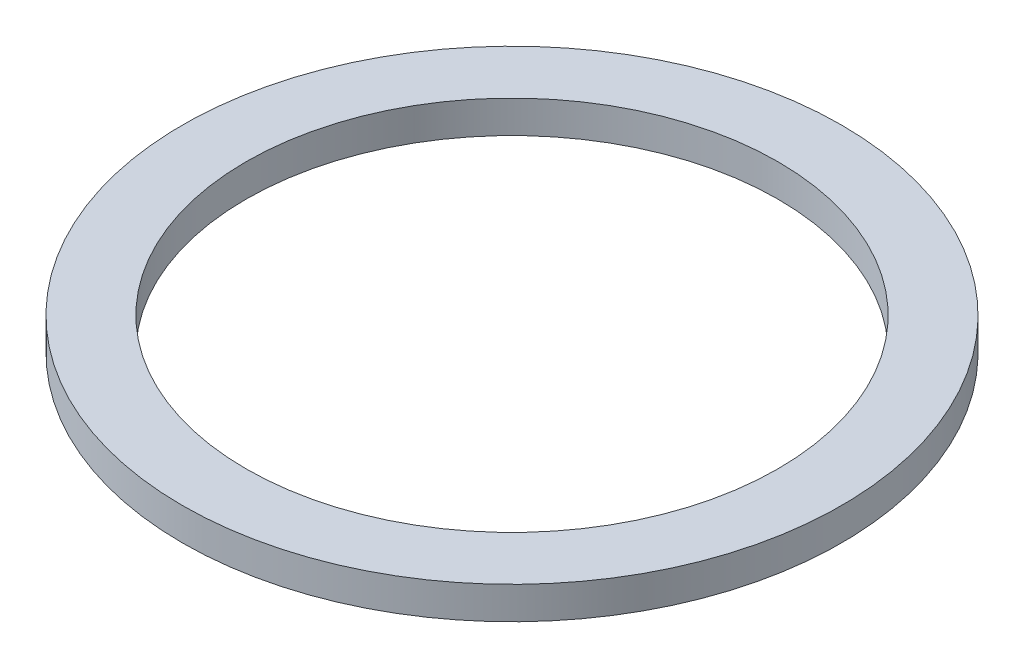
ISO-10303-21;
HEADER;
FILE_DESCRIPTION(('STEP AP214'),'2;1');
FILE_NAME('part.step','',(''),(''),'','','');
FILE_SCHEMA(('AUTOMOTIVE_DESIGN { 1 0 10303 214 1 1 1 1 }'));
ENDSEC;
DATA;
#1=APPLICATION_CONTEXT('core data for automotive mechanical design processes');
#2=APPLICATION_PROTOCOL_DEFINITION('international standard','automotive_design',2000,#1);
#3=PRODUCT_CONTEXT('',#1,'mechanical');
#4=PRODUCT('Part','Part','',(#3));
#5=PRODUCT_RELATED_PRODUCT_CATEGORY('part','',(#4));
#6=PRODUCT_DEFINITION_FORMATION('','',#4);
#7=PRODUCT_DEFINITION_CONTEXT('part definition',#1,'design');
#8=PRODUCT_DEFINITION('design','',#6,#7);
#9=PRODUCT_DEFINITION_SHAPE('','',#8);
#10=(LENGTH_UNIT() NAMED_UNIT(*) SI_UNIT(.MILLI.,.METRE.));
#11=(NAMED_UNIT(*) PLANE_ANGLE_UNIT() SI_UNIT($,.RADIAN.));
#12=(NAMED_UNIT(*) SI_UNIT($,.STERADIAN.) SOLID_ANGLE_UNIT());
#13=UNCERTAINTY_MEASURE_WITH_UNIT(LENGTH_MEASURE(1.E-05),#10,'distance_accuracy_value','');
#14=(GEOMETRIC_REPRESENTATION_CONTEXT(3) GLOBAL_UNCERTAINTY_ASSIGNED_CONTEXT((#13)) GLOBAL_UNIT_ASSIGNED_CONTEXT((#10,
#11,#12)) REPRESENTATION_CONTEXT('',''));
#15=CARTESIAN_POINT('',(0.,0.,0.));
#16=DIRECTION('',(0.,0.,1.));
#17=DIRECTION('',(1.,0.,0.));
#18=AXIS2_PLACEMENT_3D('',#15,#16,#17);
#19=CARTESIAN_POINT('',(20.5,0.,0.));
#20=DIRECTION('',(0.,1.,0.));
#21=DIRECTION('',(0.,0.,1.));
#22=AXIS2_PLACEMENT_3D('',#19,#20,#21);
#23=PLANE('',#22);
#24=CARTESIAN_POINT('',(0.,0.,0.));
#25=DIRECTION('',(0.,1.,0.));
#26=DIRECTION('',(0.,0.,1.));
#27=AXIS2_PLACEMENT_3D('',#24,#25,#26);
#28=CIRCLE('',#27,25.4);
#29=CARTESIAN_POINT('',(0.,0.,25.4));
#30=VERTEX_POINT('',#29);
#31=EDGE_CURVE('E10',#30,#30,#28,.T.);
#32=ORIENTED_EDGE('',*,*,#31,.F.);
#33=EDGE_LOOP('',(#32));
#34=FACE_BOUND('',#33,.T.);
#35=CARTESIAN_POINT('',(0.,0.,0.));
#36=DIRECTION('',(0.,1.,0.));
#37=DIRECTION('',(0.,0.,1.));
#38=AXIS2_PLACEMENT_3D('',#35,#36,#37);
#39=CIRCLE('',#38,20.5);
#40=CARTESIAN_POINT('',(0.,0.,20.5));
#41=VERTEX_POINT('',#40);
#42=EDGE_CURVE('E51',#41,#41,#39,.T.);
#43=ORIENTED_EDGE('',*,*,#42,.T.);
#44=EDGE_LOOP('',(#43));
#45=FACE_BOUND('',#44,.T.);
#46=ADVANCED_FACE('F37',(#34,#45),#23,.F.);
#47=CARTESIAN_POINT('',(0.,77.1441422656178,0.));
#48=DIRECTION('',(0.,1.,0.));
#49=DIRECTION('',(0.,0.,1.));
#50=AXIS2_PLACEMENT_3D('',#47,#48,#49);
#51=CYLINDRICAL_SURFACE('',#50,25.4);
#52=CARTESIAN_POINT('',(0.,2.5,0.));
#53=DIRECTION('',(0.,1.,0.));
#54=DIRECTION('',(0.,0.,1.));
#55=AXIS2_PLACEMENT_3D('',#52,#53,#54);
#56=CIRCLE('',#55,25.4);
#57=CARTESIAN_POINT('',(0.,2.5,25.4));
#58=VERTEX_POINT('',#57);
#59=EDGE_CURVE('E43',#58,#58,#56,.T.);
#60=ORIENTED_EDGE('',*,*,#59,.F.);
#61=EDGE_LOOP('',(#60));
#62=FACE_BOUND('',#61,.T.);
#63=ORIENTED_EDGE('',*,*,#31,.T.);
#64=EDGE_LOOP('',(#63));
#65=FACE_BOUND('',#64,.T.);
#66=ADVANCED_FACE('F66',(#62,#65),#51,.T.);
#67=CARTESIAN_POINT('',(20.5,2.5,0.));
#68=DIRECTION('',(0.,-1.,0.));
#69=DIRECTION('',(0.,0.,-1.));
#70=AXIS2_PLACEMENT_3D('',#67,#68,#69);
#71=PLANE('',#70);
#72=CARTESIAN_POINT('',(0.,2.5,0.));
#73=DIRECTION('',(0.,1.,0.));
#74=DIRECTION('',(0.,0.,1.));
#75=AXIS2_PLACEMENT_3D('',#72,#73,#74);
#76=CIRCLE('',#75,20.5);
#77=CARTESIAN_POINT('',(0.,2.5,20.5));
#78=VERTEX_POINT('',#77);
#79=EDGE_CURVE('E47',#78,#78,#76,.T.);
#80=ORIENTED_EDGE('',*,*,#79,.F.);
#81=EDGE_LOOP('',(#80));
#82=FACE_BOUND('',#81,.T.);
#83=ORIENTED_EDGE('',*,*,#59,.T.);
#84=EDGE_LOOP('',(#83));
#85=FACE_BOUND('',#84,.T.);
#86=ADVANCED_FACE('F61',(#82,#85),#71,.F.);
#87=CARTESIAN_POINT('',(0.,77.1441422656178,0.));
#88=DIRECTION('',(0.,1.,0.));
#89=DIRECTION('',(0.,0.,1.));
#90=AXIS2_PLACEMENT_3D('',#87,#88,#89);
#91=CYLINDRICAL_SURFACE('',#90,20.5);
#92=ORIENTED_EDGE('',*,*,#42,.F.);
#93=EDGE_LOOP('',(#92));
#94=FACE_BOUND('',#93,.T.);
#95=ORIENTED_EDGE('',*,*,#79,.T.);
#96=EDGE_LOOP('',(#95));
#97=FACE_BOUND('',#96,.T.);
#98=ADVANCED_FACE('F58',(#94,#97),#91,.F.);
#99=CLOSED_SHELL('',(#46,#66,#86,#98));
#100=MANIFOLD_SOLID_BREP('B2',#99);
#101=ADVANCED_BREP_SHAPE_REPRESENTATION('',(#18,#100),#14);
#102=SHAPE_DEFINITION_REPRESENTATION(#9,#101);
ENDSEC;
END-ISO-10303-21;
